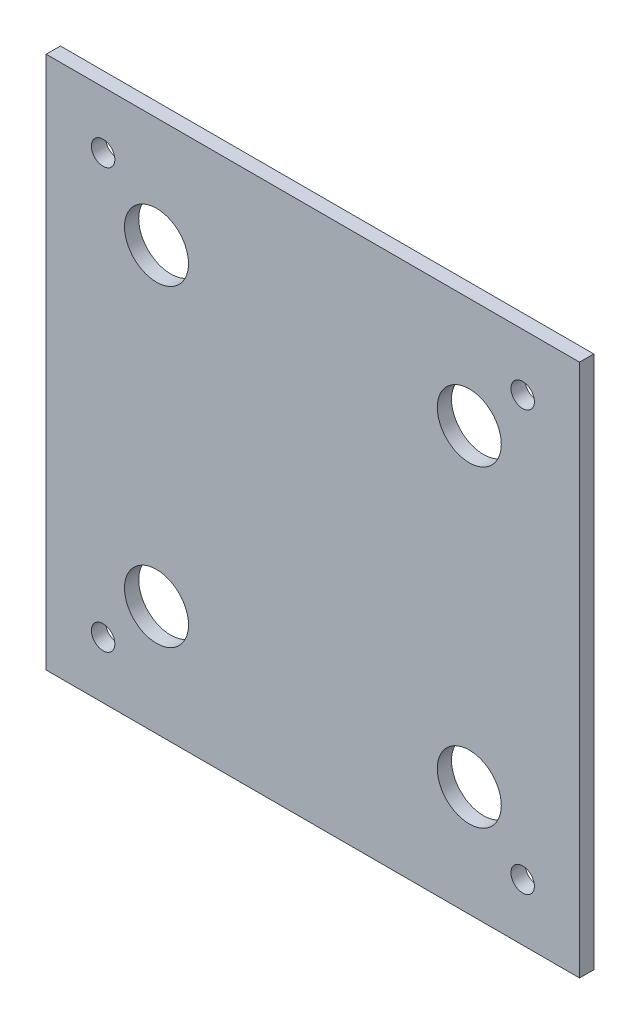
ISO-10303-21;
HEADER;
FILE_DESCRIPTION(('STEP AP214'),'2;1');
FILE_NAME('part.step','',(''),(''),'','','');
FILE_SCHEMA(('AUTOMOTIVE_DESIGN { 1 0 10303 214 1 1 1 1 }'));
ENDSEC;
DATA;
#1=APPLICATION_CONTEXT('core data for automotive mechanical design processes');
#2=APPLICATION_PROTOCOL_DEFINITION('international standard','automotive_design',2000,#1);
#3=PRODUCT_CONTEXT('',#1,'mechanical');
#4=PRODUCT('Part','Part','',(#3));
#5=PRODUCT_RELATED_PRODUCT_CATEGORY('part','',(#4));
#6=PRODUCT_DEFINITION_FORMATION('','',#4);
#7=PRODUCT_DEFINITION_CONTEXT('part definition',#1,'design');
#8=PRODUCT_DEFINITION('design','',#6,#7);
#9=PRODUCT_DEFINITION_SHAPE('','',#8);
#10=(LENGTH_UNIT() NAMED_UNIT(*) SI_UNIT(.MILLI.,.METRE.));
#11=(NAMED_UNIT(*) PLANE_ANGLE_UNIT() SI_UNIT($,.RADIAN.));
#12=(NAMED_UNIT(*) SI_UNIT($,.STERADIAN.) SOLID_ANGLE_UNIT());
#13=UNCERTAINTY_MEASURE_WITH_UNIT(LENGTH_MEASURE(1.E-05),#10,'distance_accuracy_value','');
#14=(GEOMETRIC_REPRESENTATION_CONTEXT(3) GLOBAL_UNCERTAINTY_ASSIGNED_CONTEXT((#13)) GLOBAL_UNIT_ASSIGNED_CONTEXT((#10,
#11,#12)) REPRESENTATION_CONTEXT('',''));
#15=CARTESIAN_POINT('',(0.,0.,0.));
#16=DIRECTION('',(0.,0.,1.));
#17=DIRECTION('',(1.,0.,0.));
#18=AXIS2_PLACEMENT_3D('',#15,#16,#17);
#19=CARTESIAN_POINT('',(37.5,37.5,2.));
#20=DIRECTION('',(-1.,0.,0.));
#21=DIRECTION('',(0.,0.,1.));
#22=AXIS2_PLACEMENT_3D('',#19,#20,#21);
#23=PLANE('',#22);
#24=DIRECTION('',(0.,1.,0.));
#25=VECTOR('',#24,1.);
#26=CARTESIAN_POINT('',(37.5,37.5,0.));
#27=LINE('',#26,#25);
#28=CARTESIAN_POINT('',(37.5,-37.5,0.));
#29=VERTEX_POINT('',#28);
#30=CARTESIAN_POINT('',(37.5,37.5,0.));
#31=VERTEX_POINT('',#30);
#32=EDGE_CURVE('E99',#29,#31,#27,.T.);
#33=ORIENTED_EDGE('',*,*,#32,.T.);
#34=DIRECTION('',(0.,0.,-1.));
#35=VECTOR('',#34,1.);
#36=CARTESIAN_POINT('',(37.5,37.5,2.));
#37=LINE('',#36,#35);
#38=CARTESIAN_POINT('',(37.5,37.5,2.));
#39=VERTEX_POINT('',#38);
#40=EDGE_CURVE('E11',#39,#31,#37,.T.);
#41=ORIENTED_EDGE('',*,*,#40,.F.);
#42=DIRECTION('',(0.,1.,0.));
#43=VECTOR('',#42,1.);
#44=CARTESIAN_POINT('',(37.5,37.5,2.));
#45=LINE('',#44,#43);
#46=CARTESIAN_POINT('',(37.5,-37.5,2.));
#47=VERTEX_POINT('',#46);
#48=EDGE_CURVE('E86',#47,#39,#45,.T.);
#49=ORIENTED_EDGE('',*,*,#48,.F.);
#50=DIRECTION('',(0.,0.,-1.));
#51=VECTOR('',#50,1.);
#52=CARTESIAN_POINT('',(37.5,-37.5,2.));
#53=LINE('',#52,#51);
#54=EDGE_CURVE('E95',#47,#29,#53,.T.);
#55=ORIENTED_EDGE('',*,*,#54,.T.);
#56=EDGE_LOOP('',(#33,#41,#49,#55));
#57=FACE_BOUND('',#56,.T.);
#58=ADVANCED_FACE('F34',(#57),#23,.F.);
#59=CARTESIAN_POINT('',(-37.5,37.5,2.));
#60=DIRECTION('',(0.,-1.,0.));
#61=DIRECTION('',(0.,0.,-1.));
#62=AXIS2_PLACEMENT_3D('',#59,#60,#61);
#63=PLANE('',#62);
#64=DIRECTION('',(-1.,0.,0.));
#65=VECTOR('',#64,1.);
#66=CARTESIAN_POINT('',(-37.5,37.5,0.));
#67=LINE('',#66,#65);
#68=CARTESIAN_POINT('',(-37.5,37.5,0.));
#69=VERTEX_POINT('',#68);
#70=EDGE_CURVE('E90',#31,#69,#67,.T.);
#71=ORIENTED_EDGE('',*,*,#70,.T.);
#72=DIRECTION('',(0.,0.,-1.));
#73=VECTOR('',#72,1.);
#74=CARTESIAN_POINT('',(-37.5,37.5,2.));
#75=LINE('',#74,#73);
#76=CARTESIAN_POINT('',(-37.5,37.5,2.));
#77=VERTEX_POINT('',#76);
#78=EDGE_CURVE('E43',#77,#69,#75,.T.);
#79=ORIENTED_EDGE('',*,*,#78,.F.);
#80=DIRECTION('',(-1.,0.,0.));
#81=VECTOR('',#80,1.);
#82=CARTESIAN_POINT('',(-37.5,37.5,2.));
#83=LINE('',#82,#81);
#84=EDGE_CURVE('E81',#39,#77,#83,.T.);
#85=ORIENTED_EDGE('',*,*,#84,.F.);
#86=ORIENTED_EDGE('',*,*,#40,.T.);
#87=EDGE_LOOP('',(#71,#79,#85,#86));
#88=FACE_BOUND('',#87,.T.);
#89=ADVANCED_FACE('F89',(#88),#63,.F.);
#90=CARTESIAN_POINT('',(-37.5,37.5,2.));
#91=DIRECTION('',(1.,0.,0.));
#92=DIRECTION('',(0.,1.,0.));
#93=AXIS2_PLACEMENT_3D('',#90,#91,#92);
#94=PLANE('',#93);
#95=DIRECTION('',(0.,-1.,0.));
#96=VECTOR('',#95,1.);
#97=CARTESIAN_POINT('',(-37.5,37.5,0.));
#98=LINE('',#97,#96);
#99=CARTESIAN_POINT('',(-37.5,-37.5,0.));
#100=VERTEX_POINT('',#99);
#101=EDGE_CURVE('E68',#69,#100,#98,.T.);
#102=ORIENTED_EDGE('',*,*,#101,.T.);
#103=DIRECTION('',(0.,0.,-1.));
#104=VECTOR('',#103,1.);
#105=CARTESIAN_POINT('',(-37.5,-37.5,2.));
#106=LINE('',#105,#104);
#107=CARTESIAN_POINT('',(-37.5,-37.5,2.));
#108=VERTEX_POINT('',#107);
#109=EDGE_CURVE('E91',#108,#100,#106,.T.);
#110=ORIENTED_EDGE('',*,*,#109,.F.);
#111=DIRECTION('',(0.,-1.,0.));
#112=VECTOR('',#111,1.);
#113=CARTESIAN_POINT('',(-37.5,37.5,2.));
#114=LINE('',#113,#112);
#115=EDGE_CURVE('E84',#77,#108,#114,.T.);
#116=ORIENTED_EDGE('',*,*,#115,.F.);
#117=ORIENTED_EDGE('',*,*,#78,.T.);
#118=EDGE_LOOP('',(#102,#110,#116,#117));
#119=FACE_BOUND('',#118,.T.);
#120=ADVANCED_FACE('F93',(#119),#94,.F.);
#121=CARTESIAN_POINT('',(-37.5,-37.5,2.));
#122=DIRECTION('',(0.,1.,0.));
#123=DIRECTION('',(0.,0.,1.));
#124=AXIS2_PLACEMENT_3D('',#121,#122,#123);
#125=PLANE('',#124);
#126=DIRECTION('',(1.,0.,0.));
#127=VECTOR('',#126,1.);
#128=CARTESIAN_POINT('',(-37.5,-37.5,0.));
#129=LINE('',#128,#127);
#130=EDGE_CURVE('E74',#100,#29,#129,.T.);
#131=ORIENTED_EDGE('',*,*,#130,.T.);
#132=ORIENTED_EDGE('',*,*,#54,.F.);
#133=DIRECTION('',(1.,0.,0.));
#134=VECTOR('',#133,1.);
#135=CARTESIAN_POINT('',(-37.5,-37.5,2.));
#136=LINE('',#135,#134);
#137=EDGE_CURVE('E51',#108,#47,#136,.T.);
#138=ORIENTED_EDGE('',*,*,#137,.F.);
#139=ORIENTED_EDGE('',*,*,#109,.T.);
#140=EDGE_LOOP('',(#131,#132,#138,#139));
#141=FACE_BOUND('',#140,.T.);
#142=ADVANCED_FACE('F107',(#141),#125,.F.);
#143=CARTESIAN_POINT('',(0.,0.,2.));
#144=DIRECTION('',(0.,0.,1.));
#145=DIRECTION('',(1.,0.,0.));
#146=AXIS2_PLACEMENT_3D('',#143,#144,#145);
#147=PLANE('',#146);
#148=CARTESIAN_POINT('',(21.9910208949016,-21.9910208949016,2.));
#149=DIRECTION('',(0.,0.,1.));
#150=DIRECTION('',(1.,0.,0.));
#151=AXIS2_PLACEMENT_3D('',#148,#149,#150);
#152=CIRCLE('',#151,4.5);
#153=CARTESIAN_POINT('',(26.4910208949016,-21.9910208949016,2.));
#154=VERTEX_POINT('',#153);
#155=EDGE_CURVE('E133',#154,#154,#152,.T.);
#156=ORIENTED_EDGE('',*,*,#155,.F.);
#157=EDGE_LOOP('',(#156));
#158=FACE_BOUND('',#157,.T.);
#159=CARTESIAN_POINT('',(21.9910208949016,21.9910208949016,2.));
#160=DIRECTION('',(0.,0.,1.));
#161=DIRECTION('',(1.,0.,0.));
#162=AXIS2_PLACEMENT_3D('',#159,#160,#161);
#163=CIRCLE('',#162,4.5);
#164=CARTESIAN_POINT('',(26.4910208949016,21.9910208949016,2.));
#165=VERTEX_POINT('',#164);
#166=EDGE_CURVE('E136',#165,#165,#163,.T.);
#167=ORIENTED_EDGE('',*,*,#166,.F.);
#168=EDGE_LOOP('',(#167));
#169=FACE_BOUND('',#168,.T.);
#170=CARTESIAN_POINT('',(-21.9910208949016,21.9910208949016,2.));
#171=DIRECTION('',(0.,0.,1.));
#172=DIRECTION('',(1.,0.,0.));
#173=AXIS2_PLACEMENT_3D('',#170,#171,#172);
#174=CIRCLE('',#173,4.5);
#175=CARTESIAN_POINT('',(-17.4910208949016,21.9910208949016,2.));
#176=VERTEX_POINT('',#175);
#177=EDGE_CURVE('E139',#176,#176,#174,.T.);
#178=ORIENTED_EDGE('',*,*,#177,.F.);
#179=EDGE_LOOP('',(#178));
#180=FACE_BOUND('',#179,.T.);
#181=CARTESIAN_POINT('',(-21.9910208949016,-21.9910208949016,2.));
#182=DIRECTION('',(0.,0.,1.));
#183=DIRECTION('',(1.,0.,0.));
#184=AXIS2_PLACEMENT_3D('',#181,#182,#183);
#185=CIRCLE('',#184,4.5);
#186=CARTESIAN_POINT('',(-17.4910208949016,-21.9910208949016,2.));
#187=VERTEX_POINT('',#186);
#188=EDGE_CURVE('E142',#187,#187,#185,.T.);
#189=ORIENTED_EDGE('',*,*,#188,.F.);
#190=EDGE_LOOP('',(#189));
#191=FACE_BOUND('',#190,.T.);
#192=CARTESIAN_POINT('',(-29.5,-29.5,2.));
#193=DIRECTION('',(0.,0.,1.));
#194=DIRECTION('',(1.,0.,0.));
#195=AXIS2_PLACEMENT_3D('',#192,#193,#194);
#196=CIRCLE('',#195,1.65);
#197=CARTESIAN_POINT('',(-27.85,-29.5,2.));
#198=VERTEX_POINT('',#197);
#199=EDGE_CURVE('E127',#198,#198,#196,.T.);
#200=ORIENTED_EDGE('',*,*,#199,.F.);
#201=EDGE_LOOP('',(#200));
#202=FACE_BOUND('',#201,.T.);
#203=CARTESIAN_POINT('',(-29.5,29.5,2.));
#204=DIRECTION('',(0.,0.,1.));
#205=DIRECTION('',(1.,0.,0.));
#206=AXIS2_PLACEMENT_3D('',#203,#204,#205);
#207=CIRCLE('',#206,1.65);
#208=CARTESIAN_POINT('',(-27.85,29.5,2.));
#209=VERTEX_POINT('',#208);
#210=EDGE_CURVE('E121',#209,#209,#207,.T.);
#211=ORIENTED_EDGE('',*,*,#210,.F.);
#212=EDGE_LOOP('',(#211));
#213=FACE_BOUND('',#212,.T.);
#214=CARTESIAN_POINT('',(29.5,29.5,2.));
#215=DIRECTION('',(0.,0.,1.));
#216=DIRECTION('',(1.,0.,0.));
#217=AXIS2_PLACEMENT_3D('',#214,#215,#216);
#218=CIRCLE('',#217,1.65);
#219=CARTESIAN_POINT('',(31.15,29.5,2.));
#220=VERTEX_POINT('',#219);
#221=EDGE_CURVE('E37',#220,#220,#218,.T.);
#222=ORIENTED_EDGE('',*,*,#221,.F.);
#223=EDGE_LOOP('',(#222));
#224=FACE_BOUND('',#223,.T.);
#225=CARTESIAN_POINT('',(29.5,-29.5,2.));
#226=DIRECTION('',(0.,0.,1.));
#227=DIRECTION('',(1.,0.,0.));
#228=AXIS2_PLACEMENT_3D('',#225,#226,#227);
#229=CIRCLE('',#228,1.65);
#230=CARTESIAN_POINT('',(31.15,-29.5,2.));
#231=VERTEX_POINT('',#230);
#232=EDGE_CURVE('E102',#231,#231,#229,.T.);
#233=ORIENTED_EDGE('',*,*,#232,.F.);
#234=EDGE_LOOP('',(#233));
#235=FACE_BOUND('',#234,.T.);
#236=ORIENTED_EDGE('',*,*,#48,.T.);
#237=ORIENTED_EDGE('',*,*,#84,.T.);
#238=ORIENTED_EDGE('',*,*,#115,.T.);
#239=ORIENTED_EDGE('',*,*,#137,.T.);
#240=EDGE_LOOP('',(#236,#237,#238,#239));
#241=FACE_BOUND('',#240,.T.);
#242=ADVANCED_FACE('F82',(#158,#169,#180,#191,#202,#213,#224,#235,#241),#147,.T.);
#243=CARTESIAN_POINT('',(0.,0.,0.));
#244=DIRECTION('',(0.,0.,1.));
#245=DIRECTION('',(1.,0.,0.));
#246=AXIS2_PLACEMENT_3D('',#243,#244,#245);
#247=PLANE('',#246);
#248=CARTESIAN_POINT('',(21.9910208949016,-21.9910208949016,0.));
#249=DIRECTION('',(0.,0.,-1.));
#250=DIRECTION('',(-1.,0.,0.));
#251=AXIS2_PLACEMENT_3D('',#248,#249,#250);
#252=CIRCLE('',#251,4.5);
#253=CARTESIAN_POINT('',(17.4910208949016,-21.9910208949016,0.));
#254=VERTEX_POINT('',#253);
#255=EDGE_CURVE('E149',#254,#254,#252,.T.);
#256=ORIENTED_EDGE('',*,*,#255,.F.);
#257=EDGE_LOOP('',(#256));
#258=FACE_BOUND('',#257,.T.);
#259=CARTESIAN_POINT('',(21.9910208949016,21.9910208949016,0.));
#260=DIRECTION('',(0.,0.,-1.));
#261=DIRECTION('',(-1.,0.,0.));
#262=AXIS2_PLACEMENT_3D('',#259,#260,#261);
#263=CIRCLE('',#262,4.5);
#264=CARTESIAN_POINT('',(17.4910208949016,21.9910208949016,0.));
#265=VERTEX_POINT('',#264);
#266=EDGE_CURVE('E152',#265,#265,#263,.T.);
#267=ORIENTED_EDGE('',*,*,#266,.F.);
#268=EDGE_LOOP('',(#267));
#269=FACE_BOUND('',#268,.T.);
#270=CARTESIAN_POINT('',(-21.9910208949016,21.9910208949016,0.));
#271=DIRECTION('',(0.,0.,-1.));
#272=DIRECTION('',(-1.,0.,0.));
#273=AXIS2_PLACEMENT_3D('',#270,#271,#272);
#274=CIRCLE('',#273,4.5);
#275=CARTESIAN_POINT('',(-26.4910208949016,21.9910208949016,0.));
#276=VERTEX_POINT('',#275);
#277=EDGE_CURVE('E148',#276,#276,#274,.T.);
#278=ORIENTED_EDGE('',*,*,#277,.F.);
#279=EDGE_LOOP('',(#278));
#280=FACE_BOUND('',#279,.T.);
#281=CARTESIAN_POINT('',(-21.9910208949016,-21.9910208949016,0.));
#282=DIRECTION('',(0.,0.,-1.));
#283=DIRECTION('',(-1.,0.,0.));
#284=AXIS2_PLACEMENT_3D('',#281,#282,#283);
#285=CIRCLE('',#284,4.5);
#286=CARTESIAN_POINT('',(-26.4910208949016,-21.9910208949016,0.));
#287=VERTEX_POINT('',#286);
#288=EDGE_CURVE('E145',#287,#287,#285,.T.);
#289=ORIENTED_EDGE('',*,*,#288,.F.);
#290=EDGE_LOOP('',(#289));
#291=FACE_BOUND('',#290,.T.);
#292=CARTESIAN_POINT('',(-29.5,-29.5,0.));
#293=DIRECTION('',(0.,0.,-1.));
#294=DIRECTION('',(-1.,0.,0.));
#295=AXIS2_PLACEMENT_3D('',#292,#293,#294);
#296=CIRCLE('',#295,1.64999999999999);
#297=CARTESIAN_POINT('',(-31.15,-29.5,0.));
#298=VERTEX_POINT('',#297);
#299=EDGE_CURVE('E130',#298,#298,#296,.T.);
#300=ORIENTED_EDGE('',*,*,#299,.F.);
#301=EDGE_LOOP('',(#300));
#302=FACE_BOUND('',#301,.T.);
#303=CARTESIAN_POINT('',(-29.5,29.5,0.));
#304=DIRECTION('',(0.,0.,-1.));
#305=DIRECTION('',(-1.,0.,0.));
#306=AXIS2_PLACEMENT_3D('',#303,#304,#305);
#307=CIRCLE('',#306,1.64999999999999);
#308=CARTESIAN_POINT('',(-31.15,29.5,0.));
#309=VERTEX_POINT('',#308);
#310=EDGE_CURVE('E124',#309,#309,#307,.T.);
#311=ORIENTED_EDGE('',*,*,#310,.F.);
#312=EDGE_LOOP('',(#311));
#313=FACE_BOUND('',#312,.T.);
#314=CARTESIAN_POINT('',(29.5,29.5,0.));
#315=DIRECTION('',(0.,0.,-1.));
#316=DIRECTION('',(-1.,0.,0.));
#317=AXIS2_PLACEMENT_3D('',#314,#315,#316);
#318=CIRCLE('',#317,1.64999999999999);
#319=CARTESIAN_POINT('',(27.85,29.5,0.));
#320=VERTEX_POINT('',#319);
#321=EDGE_CURVE('E118',#320,#320,#318,.T.);
#322=ORIENTED_EDGE('',*,*,#321,.F.);
#323=EDGE_LOOP('',(#322));
#324=FACE_BOUND('',#323,.T.);
#325=CARTESIAN_POINT('',(29.5,-29.5,0.));
#326=DIRECTION('',(0.,0.,-1.));
#327=DIRECTION('',(-1.,0.,0.));
#328=AXIS2_PLACEMENT_3D('',#325,#326,#327);
#329=CIRCLE('',#328,1.64999999999999);
#330=CARTESIAN_POINT('',(27.85,-29.5,0.));
#331=VERTEX_POINT('',#330);
#332=EDGE_CURVE('E115',#331,#331,#329,.T.);
#333=ORIENTED_EDGE('',*,*,#332,.F.);
#334=EDGE_LOOP('',(#333));
#335=FACE_BOUND('',#334,.T.);
#336=ORIENTED_EDGE('',*,*,#32,.F.);
#337=ORIENTED_EDGE('',*,*,#130,.F.);
#338=ORIENTED_EDGE('',*,*,#101,.F.);
#339=ORIENTED_EDGE('',*,*,#70,.F.);
#340=EDGE_LOOP('',(#336,#337,#338,#339));
#341=FACE_BOUND('',#340,.T.);
#342=ADVANCED_FACE('F110',(#258,#269,#280,#291,#302,#313,#324,#335,#341),#247,.F.);
#343=CARTESIAN_POINT('',(29.5,-29.5,0.));
#344=DIRECTION('',(0.,0.,-1.));
#345=DIRECTION('',(-1.,0.,0.));
#346=AXIS2_PLACEMENT_3D('',#343,#344,#345);
#347=CYLINDRICAL_SURFACE('',#346,1.65);
#348=ORIENTED_EDGE('',*,*,#232,.T.);
#349=EDGE_LOOP('',(#348));
#350=FACE_BOUND('',#349,.T.);
#351=ORIENTED_EDGE('',*,*,#332,.T.);
#352=EDGE_LOOP('',(#351));
#353=FACE_BOUND('',#352,.T.);
#354=ADVANCED_FACE('F162',(#350,#353),#347,.F.);
#355=CARTESIAN_POINT('',(29.5,29.5,0.));
#356=DIRECTION('',(0.,0.,-1.));
#357=DIRECTION('',(-1.,0.,0.));
#358=AXIS2_PLACEMENT_3D('',#355,#356,#357);
#359=CYLINDRICAL_SURFACE('',#358,1.65);
#360=ORIENTED_EDGE('',*,*,#221,.T.);
#361=EDGE_LOOP('',(#360));
#362=FACE_BOUND('',#361,.T.);
#363=ORIENTED_EDGE('',*,*,#321,.T.);
#364=EDGE_LOOP('',(#363));
#365=FACE_BOUND('',#364,.T.);
#366=ADVANCED_FACE('F176',(#362,#365),#359,.F.);
#367=CARTESIAN_POINT('',(-29.5,29.5,0.));
#368=DIRECTION('',(0.,0.,-1.));
#369=DIRECTION('',(-1.,0.,0.));
#370=AXIS2_PLACEMENT_3D('',#367,#368,#369);
#371=CYLINDRICAL_SURFACE('',#370,1.65);
#372=ORIENTED_EDGE('',*,*,#210,.T.);
#373=EDGE_LOOP('',(#372));
#374=FACE_BOUND('',#373,.T.);
#375=ORIENTED_EDGE('',*,*,#310,.T.);
#376=EDGE_LOOP('',(#375));
#377=FACE_BOUND('',#376,.T.);
#378=ADVANCED_FACE('F183',(#374,#377),#371,.F.);
#379=CARTESIAN_POINT('',(-29.5,-29.5,0.));
#380=DIRECTION('',(0.,0.,-1.));
#381=DIRECTION('',(-1.,0.,0.));
#382=AXIS2_PLACEMENT_3D('',#379,#380,#381);
#383=CYLINDRICAL_SURFACE('',#382,1.65);
#384=ORIENTED_EDGE('',*,*,#199,.T.);
#385=EDGE_LOOP('',(#384));
#386=FACE_BOUND('',#385,.T.);
#387=ORIENTED_EDGE('',*,*,#299,.T.);
#388=EDGE_LOOP('',(#387));
#389=FACE_BOUND('',#388,.T.);
#390=ADVANCED_FACE('F222',(#386,#389),#383,.F.);
#391=CARTESIAN_POINT('',(-21.9910208949016,-21.9910208949016,80.));
#392=DIRECTION('',(0.,0.,-1.));
#393=DIRECTION('',(-1.,0.,0.));
#394=AXIS2_PLACEMENT_3D('',#391,#392,#393);
#395=CYLINDRICAL_SURFACE('',#394,4.5);
#396=ORIENTED_EDGE('',*,*,#188,.T.);
#397=EDGE_LOOP('',(#396));
#398=FACE_BOUND('',#397,.T.);
#399=ORIENTED_EDGE('',*,*,#288,.T.);
#400=EDGE_LOOP('',(#399));
#401=FACE_BOUND('',#400,.T.);
#402=ADVANCED_FACE('F227',(#398,#401),#395,.F.);
#403=CARTESIAN_POINT('',(-21.9910208949016,21.9910208949016,80.));
#404=DIRECTION('',(0.,0.,-1.));
#405=DIRECTION('',(-1.,0.,0.));
#406=AXIS2_PLACEMENT_3D('',#403,#404,#405);
#407=CYLINDRICAL_SURFACE('',#406,4.5);
#408=ORIENTED_EDGE('',*,*,#177,.T.);
#409=EDGE_LOOP('',(#408));
#410=FACE_BOUND('',#409,.T.);
#411=ORIENTED_EDGE('',*,*,#277,.T.);
#412=EDGE_LOOP('',(#411));
#413=FACE_BOUND('',#412,.T.);
#414=ADVANCED_FACE('F158',(#410,#413),#407,.F.);
#415=CARTESIAN_POINT('',(21.9910208949016,21.9910208949016,80.));
#416=DIRECTION('',(0.,0.,-1.));
#417=DIRECTION('',(-1.,0.,0.));
#418=AXIS2_PLACEMENT_3D('',#415,#416,#417);
#419=CYLINDRICAL_SURFACE('',#418,4.5);
#420=ORIENTED_EDGE('',*,*,#166,.T.);
#421=EDGE_LOOP('',(#420));
#422=FACE_BOUND('',#421,.T.);
#423=ORIENTED_EDGE('',*,*,#266,.T.);
#424=EDGE_LOOP('',(#423));
#425=FACE_BOUND('',#424,.T.);
#426=ADVANCED_FACE('F237',(#422,#425),#419,.F.);
#427=CARTESIAN_POINT('',(21.9910208949016,-21.9910208949016,80.));
#428=DIRECTION('',(0.,0.,-1.));
#429=DIRECTION('',(-1.,0.,0.));
#430=AXIS2_PLACEMENT_3D('',#427,#428,#429);
#431=CYLINDRICAL_SURFACE('',#430,4.5);
#432=ORIENTED_EDGE('',*,*,#155,.T.);
#433=EDGE_LOOP('',(#432));
#434=FACE_BOUND('',#433,.T.);
#435=ORIENTED_EDGE('',*,*,#255,.T.);
#436=EDGE_LOOP('',(#435));
#437=FACE_BOUND('',#436,.T.);
#438=ADVANCED_FACE('F234',(#434,#437),#431,.F.);
#439=CLOSED_SHELL('',(#58,#89,#120,#142,#242,#342,#354,#366,#378,#390,#402,#414,#426,#438));
#440=MANIFOLD_SOLID_BREP('B2',#439);
#441=ADVANCED_BREP_SHAPE_REPRESENTATION('',(#18,#440),#14);
#442=SHAPE_DEFINITION_REPRESENTATION(#9,#441);
ENDSEC;
END-ISO-10303-21;
